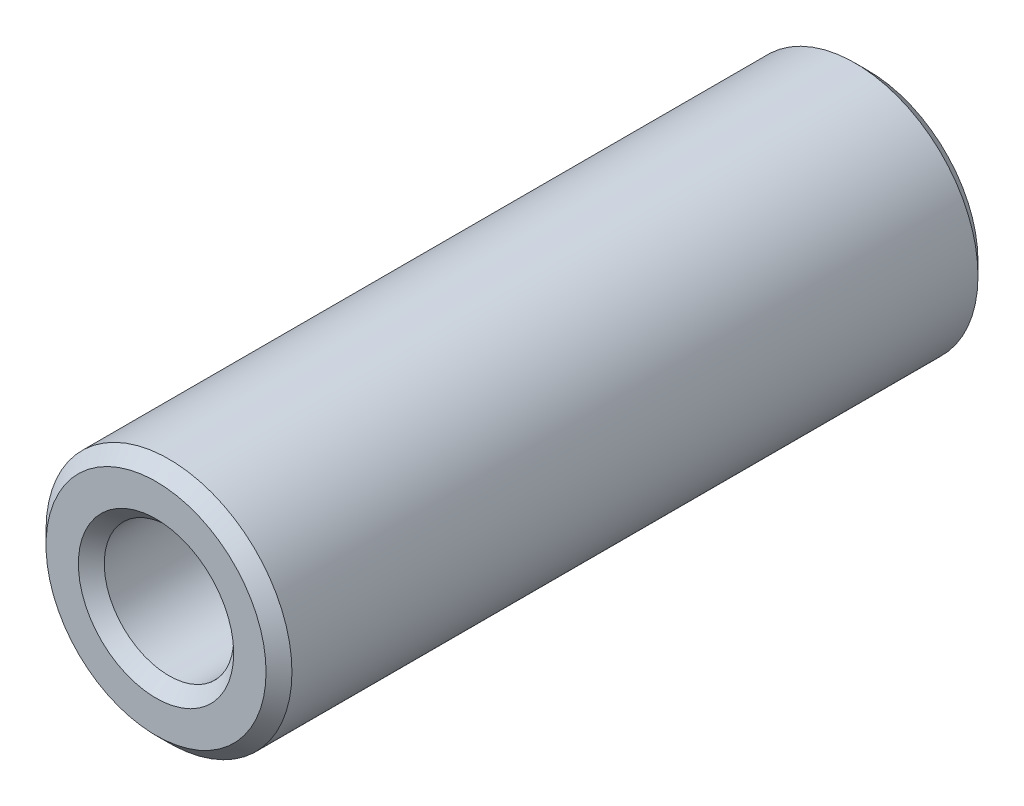
ISO-10303-21;
HEADER;
FILE_DESCRIPTION(('STEP AP214'),'2;1');
FILE_NAME('part.step','',(''),(''),'','','');
FILE_SCHEMA(('AUTOMOTIVE_DESIGN { 1 0 10303 214 1 1 1 1 }'));
ENDSEC;
DATA;
#1=APPLICATION_CONTEXT('core data for automotive mechanical design processes');
#2=APPLICATION_PROTOCOL_DEFINITION('international standard','automotive_design',2000,#1);
#3=PRODUCT_CONTEXT('',#1,'mechanical');
#4=PRODUCT('Part','Part','',(#3));
#5=PRODUCT_RELATED_PRODUCT_CATEGORY('part','',(#4));
#6=PRODUCT_DEFINITION_FORMATION('','',#4);
#7=PRODUCT_DEFINITION_CONTEXT('part definition',#1,'design');
#8=PRODUCT_DEFINITION('design','',#6,#7);
#9=PRODUCT_DEFINITION_SHAPE('','',#8);
#10=(LENGTH_UNIT() NAMED_UNIT(*) SI_UNIT(.MILLI.,.METRE.));
#11=(NAMED_UNIT(*) PLANE_ANGLE_UNIT() SI_UNIT($,.RADIAN.));
#12=(NAMED_UNIT(*) SI_UNIT($,.STERADIAN.) SOLID_ANGLE_UNIT());
#13=UNCERTAINTY_MEASURE_WITH_UNIT(LENGTH_MEASURE(1.E-05),#10,'distance_accuracy_value','');
#14=(GEOMETRIC_REPRESENTATION_CONTEXT(3) GLOBAL_UNCERTAINTY_ASSIGNED_CONTEXT((#13)) GLOBAL_UNIT_ASSIGNED_CONTEXT((#10,
#11,#12)) REPRESENTATION_CONTEXT('',''));
#15=CARTESIAN_POINT('',(0.,0.,0.));
#16=DIRECTION('',(0.,0.,1.));
#17=DIRECTION('',(1.,0.,0.));
#18=AXIS2_PLACEMENT_3D('',#15,#16,#17);
#19=CARTESIAN_POINT('',(0.,0.,55.));
#20=DIRECTION('',(0.,0.,1.));
#21=DIRECTION('',(1.,0.,0.));
#22=AXIS2_PLACEMENT_3D('',#19,#20,#21);
#23=PLANE('',#22);
#24=CARTESIAN_POINT('',(0.,0.,55.));
#25=DIRECTION('',(0.,0.,1.));
#26=DIRECTION('',(1.,0.,0.));
#27=AXIS2_PLACEMENT_3D('',#24,#25,#26);
#28=CIRCLE('',#27,8.5);
#29=CARTESIAN_POINT('',(8.5,0.,55.));
#30=VERTEX_POINT('',#29);
#31=EDGE_CURVE('E42',#30,#30,#28,.T.);
#32=ORIENTED_EDGE('',*,*,#31,.T.);
#33=EDGE_LOOP('',(#32));
#34=FACE_BOUND('',#33,.T.);
#35=CARTESIAN_POINT('',(0.,0.,55.));
#36=DIRECTION('',(0.,0.,1.));
#37=DIRECTION('',(1.,0.,0.));
#38=AXIS2_PLACEMENT_3D('',#35,#36,#37);
#39=CIRCLE('',#38,6.00000000000003);
#40=CARTESIAN_POINT('',(6.00000000000003,0.,55.));
#41=VERTEX_POINT('',#40);
#42=EDGE_CURVE('E46',#41,#41,#39,.F.);
#43=ORIENTED_EDGE('',*,*,#42,.T.);
#44=EDGE_LOOP('',(#43));
#45=FACE_BOUND('',#44,.T.);
#46=ADVANCED_FACE('F31',(#34,#45),#23,.T.);
#47=CARTESIAN_POINT('',(0.,0.,0.));
#48=DIRECTION('',(0.,0.,1.));
#49=DIRECTION('',(1.,0.,0.));
#50=AXIS2_PLACEMENT_3D('',#47,#48,#49);
#51=PLANE('',#50);
#52=CARTESIAN_POINT('',(0.,0.,0.));
#53=DIRECTION('',(0.,0.,1.));
#54=DIRECTION('',(1.,0.,0.));
#55=AXIS2_PLACEMENT_3D('',#52,#53,#54);
#56=CIRCLE('',#55,8.49999999999999);
#57=CARTESIAN_POINT('',(8.49999999999999,0.,0.));
#58=VERTEX_POINT('',#57);
#59=EDGE_CURVE('E51',#58,#58,#56,.F.);
#60=ORIENTED_EDGE('',*,*,#59,.T.);
#61=EDGE_LOOP('',(#60));
#62=FACE_BOUND('',#61,.T.);
#63=CARTESIAN_POINT('',(0.,0.,0.));
#64=DIRECTION('',(0.,0.,1.));
#65=DIRECTION('',(1.,0.,0.));
#66=AXIS2_PLACEMENT_3D('',#63,#64,#65);
#67=CIRCLE('',#66,6.00000000000001);
#68=CARTESIAN_POINT('',(6.00000000000001,0.,0.));
#69=VERTEX_POINT('',#68);
#70=EDGE_CURVE('E54',#69,#69,#67,.T.);
#71=ORIENTED_EDGE('',*,*,#70,.T.);
#72=EDGE_LOOP('',(#71));
#73=FACE_BOUND('',#72,.T.);
#74=ADVANCED_FACE('F76',(#62,#73),#51,.F.);
#75=CARTESIAN_POINT('',(0.,0.,55.));
#76=DIRECTION('',(0.,0.,-1.));
#77=DIRECTION('',(-1.,0.,0.));
#78=AXIS2_PLACEMENT_3D('',#75,#76,#77);
#79=CYLINDRICAL_SURFACE('',#78,9.5);
#80=CARTESIAN_POINT('',(0.,0.,1.00000000000001));
#81=DIRECTION('',(0.,0.,1.));
#82=DIRECTION('',(1.,0.,0.));
#83=AXIS2_PLACEMENT_3D('',#80,#81,#82);
#84=CIRCLE('',#83,9.5);
#85=CARTESIAN_POINT('',(9.5,0.,1.00000000000001));
#86=VERTEX_POINT('',#85);
#87=EDGE_CURVE('E57',#86,#86,#84,.T.);
#88=ORIENTED_EDGE('',*,*,#87,.T.);
#89=EDGE_LOOP('',(#88));
#90=FACE_BOUND('',#89,.T.);
#91=CARTESIAN_POINT('',(0.,0.,54.));
#92=DIRECTION('',(0.,0.,1.));
#93=DIRECTION('',(1.,0.,0.));
#94=AXIS2_PLACEMENT_3D('',#91,#92,#93);
#95=CIRCLE('',#94,9.5);
#96=CARTESIAN_POINT('',(9.5,0.,54.));
#97=VERTEX_POINT('',#96);
#98=EDGE_CURVE('E60',#97,#97,#95,.F.);
#99=ORIENTED_EDGE('',*,*,#98,.T.);
#100=EDGE_LOOP('',(#99));
#101=FACE_BOUND('',#100,.T.);
#102=ADVANCED_FACE('F64',(#90,#101),#79,.T.);
#103=CARTESIAN_POINT('',(0.,0.,55.));
#104=DIRECTION('',(0.,0.,-1.));
#105=DIRECTION('',(-1.,0.,0.));
#106=AXIS2_PLACEMENT_3D('',#103,#104,#105);
#107=CYLINDRICAL_SURFACE('',#106,5.);
#108=CARTESIAN_POINT('',(0.,0.,1.00000000000001));
#109=DIRECTION('',(0.,0.,1.));
#110=DIRECTION('',(1.,0.,0.));
#111=AXIS2_PLACEMENT_3D('',#108,#109,#110);
#112=CIRCLE('',#111,5.);
#113=CARTESIAN_POINT('',(5.,0.,1.00000000000001));
#114=VERTEX_POINT('',#113);
#115=EDGE_CURVE('E10',#114,#114,#112,.F.);
#116=ORIENTED_EDGE('',*,*,#115,.T.);
#117=EDGE_LOOP('',(#116));
#118=FACE_BOUND('',#117,.T.);
#119=CARTESIAN_POINT('',(0.,0.,54.));
#120=DIRECTION('',(0.,0.,1.));
#121=DIRECTION('',(1.,0.,0.));
#122=AXIS2_PLACEMENT_3D('',#119,#120,#121);
#123=CIRCLE('',#122,5.);
#124=CARTESIAN_POINT('',(5.,0.,54.));
#125=VERTEX_POINT('',#124);
#126=EDGE_CURVE('E38',#125,#125,#123,.T.);
#127=ORIENTED_EDGE('',*,*,#126,.T.);
#128=EDGE_LOOP('',(#127));
#129=FACE_BOUND('',#128,.T.);
#130=ADVANCED_FACE('F92',(#118,#129),#107,.F.);
#131=CARTESIAN_POINT('',(0.,0.,1.00000000000001));
#132=DIRECTION('',(0.,0.,1.));
#133=DIRECTION('',(1.,0.,0.));
#134=AXIS2_PLACEMENT_3D('',#131,#132,#133);
#135=CONICAL_SURFACE('',#134,9.5,0.785398163397447);
#136=ORIENTED_EDGE('',*,*,#59,.F.);
#137=EDGE_LOOP('',(#136));
#138=FACE_BOUND('',#137,.T.);
#139=ORIENTED_EDGE('',*,*,#87,.F.);
#140=EDGE_LOOP('',(#139));
#141=FACE_BOUND('',#140,.T.);
#142=ADVANCED_FACE('F70',(#138,#141),#135,.T.);
#143=CARTESIAN_POINT('',(0.,0.,55.));
#144=DIRECTION('',(0.,0.,-1.));
#145=DIRECTION('',(-1.,0.,0.));
#146=AXIS2_PLACEMENT_3D('',#143,#144,#145);
#147=CONICAL_SURFACE('',#146,8.5,0.785398163397444);
#148=ORIENTED_EDGE('',*,*,#98,.F.);
#149=EDGE_LOOP('',(#148));
#150=FACE_BOUND('',#149,.T.);
#151=ORIENTED_EDGE('',*,*,#31,.F.);
#152=EDGE_LOOP('',(#151));
#153=FACE_BOUND('',#152,.T.);
#154=ADVANCED_FACE('F66',(#150,#153),#147,.T.);
#155=CARTESIAN_POINT('',(0.,0.,0.));
#156=DIRECTION('',(0.,0.,-1.));
#157=DIRECTION('',(-1.,0.,0.));
#158=AXIS2_PLACEMENT_3D('',#155,#156,#157);
#159=CONICAL_SURFACE('',#158,6.00000000000001,0.785398163397447);
#160=ORIENTED_EDGE('',*,*,#115,.F.);
#161=EDGE_LOOP('',(#160));
#162=FACE_BOUND('',#161,.T.);
#163=ORIENTED_EDGE('',*,*,#70,.F.);
#164=EDGE_LOOP('',(#163));
#165=FACE_BOUND('',#164,.T.);
#166=ADVANCED_FACE('F69',(#162,#165),#159,.F.);
#167=CARTESIAN_POINT('',(0.,0.,54.));
#168=DIRECTION('',(0.,0.,1.));
#169=DIRECTION('',(1.,0.,0.));
#170=AXIS2_PLACEMENT_3D('',#167,#168,#169);
#171=CONICAL_SURFACE('',#170,5.,0.785398163397457);
#172=ORIENTED_EDGE('',*,*,#42,.F.);
#173=EDGE_LOOP('',(#172));
#174=FACE_BOUND('',#173,.T.);
#175=ORIENTED_EDGE('',*,*,#126,.F.);
#176=EDGE_LOOP('',(#175));
#177=FACE_BOUND('',#176,.T.);
#178=ADVANCED_FACE('F33',(#174,#177),#171,.F.);
#179=CLOSED_SHELL('',(#46,#74,#102,#130,#142,#154,#166,#178));
#180=MANIFOLD_SOLID_BREP('B2',#179);
#181=ADVANCED_BREP_SHAPE_REPRESENTATION('',(#18,#180),#14);
#182=SHAPE_DEFINITION_REPRESENTATION(#9,#181);
ENDSEC;
END-ISO-10303-21;
